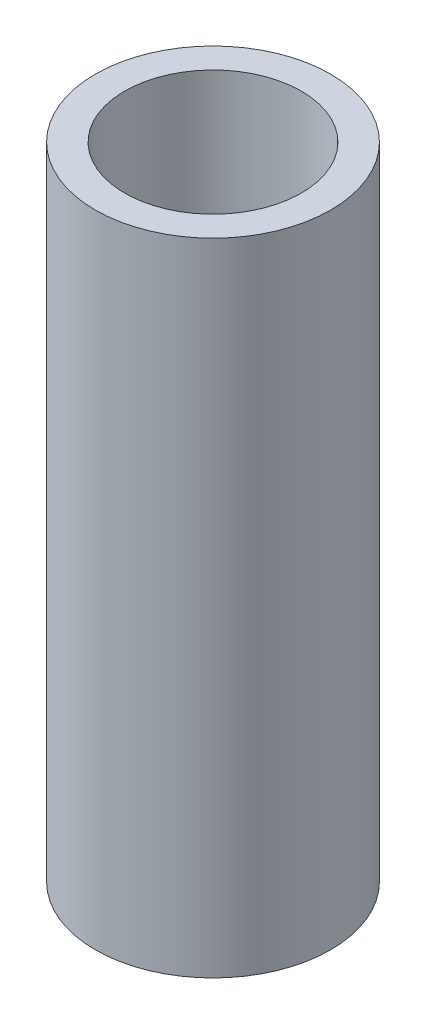
ISO-10303-21;
HEADER;
FILE_DESCRIPTION(('STEP AP214'),'2;1');
FILE_NAME('part.step','',(''),(''),'','','');
FILE_SCHEMA(('AUTOMOTIVE_DESIGN { 1 0 10303 214 1 1 1 1 }'));
ENDSEC;
DATA;
#1=APPLICATION_CONTEXT('core data for automotive mechanical design processes');
#2=APPLICATION_PROTOCOL_DEFINITION('international standard','automotive_design',2000,#1);
#3=PRODUCT_CONTEXT('',#1,'mechanical');
#4=PRODUCT('Part','Part','',(#3));
#5=PRODUCT_RELATED_PRODUCT_CATEGORY('part','',(#4));
#6=PRODUCT_DEFINITION_FORMATION('','',#4);
#7=PRODUCT_DEFINITION_CONTEXT('part definition',#1,'design');
#8=PRODUCT_DEFINITION('design','',#6,#7);
#9=PRODUCT_DEFINITION_SHAPE('','',#8);
#10=(LENGTH_UNIT() NAMED_UNIT(*) SI_UNIT(.MILLI.,.METRE.));
#11=(NAMED_UNIT(*) PLANE_ANGLE_UNIT() SI_UNIT($,.RADIAN.));
#12=(NAMED_UNIT(*) SI_UNIT($,.STERADIAN.) SOLID_ANGLE_UNIT());
#13=UNCERTAINTY_MEASURE_WITH_UNIT(LENGTH_MEASURE(1.E-05),#10,'distance_accuracy_value','');
#14=(GEOMETRIC_REPRESENTATION_CONTEXT(3) GLOBAL_UNCERTAINTY_ASSIGNED_CONTEXT((#13)) GLOBAL_UNIT_ASSIGNED_CONTEXT((#10,
#11,#12)) REPRESENTATION_CONTEXT('',''));
#15=CARTESIAN_POINT('',(0.,0.,0.));
#16=DIRECTION('',(0.,0.,1.));
#17=DIRECTION('',(1.,0.,0.));
#18=AXIS2_PLACEMENT_3D('',#15,#16,#17);
#19=CARTESIAN_POINT('',(0.,108.882062630455,0.));
#20=DIRECTION('',(0.,-1.,0.));
#21=DIRECTION('',(0.,0.,-1.));
#22=AXIS2_PLACEMENT_3D('',#19,#20,#21);
#23=CYLINDRICAL_SURFACE('',#22,20.);
#24=CARTESIAN_POINT('',(0.,108.882062630455,0.));
#25=DIRECTION('',(0.,1.,0.));
#26=DIRECTION('',(0.,0.,1.));
#27=AXIS2_PLACEMENT_3D('',#24,#25,#26);
#28=CIRCLE('',#27,20.);
#29=CARTESIAN_POINT('',(0.,108.882062630455,-20.));
#30=VERTEX_POINT('',#29);
#31=EDGE_CURVE('E10',#30,#30,#28,.T.);
#32=CARTESIAN_POINT('',(0.,0.,0.));
#33=DIRECTION('',(0.,1.,0.));
#34=DIRECTION('',(0.,0.,1.));
#35=AXIS2_PLACEMENT_3D('',#32,#33,#34);
#36=CIRCLE('',#35,20.);
#37=CARTESIAN_POINT('',(0.,0.,-20.));
#38=VERTEX_POINT('',#37);
#39=EDGE_CURVE('E37',#38,#38,#36,.T.);
#40=CARTESIAN_POINT('',(0.,108.882062630455,-20.));
#41=CARTESIAN_POINT('',(0.,107.747874478054,-20.));
#42=CARTESIAN_POINT('',(0.,106.613686325654,-20.));
#43=CARTESIAN_POINT('',(0.,104.345310020852,-20.));
#44=CARTESIAN_POINT('',(0.,103.211121868452,-20.));
#45=CARTESIAN_POINT('',(0.,100.942745563651,-20.));
#46=CARTESIAN_POINT('',(0.,99.8085574112501,-20.));
#47=CARTESIAN_POINT('',(0.,97.540181106449,-20.));
#48=CARTESIAN_POINT('',(0.,96.4059929540484,-20.));
#49=CARTESIAN_POINT('',(0.,94.1376166492472,-20.));
#50=CARTESIAN_POINT('',(0.,93.0034284968467,-20.));
#51=CARTESIAN_POINT('',(0.,90.7350521920455,-20.));
#52=CARTESIAN_POINT('',(0.,89.600864039645,-20.));
#53=CARTESIAN_POINT('',(0.,87.3324877348438,-20.));
#54=CARTESIAN_POINT('',(0.,86.1982995824433,-20.));
#55=CARTESIAN_POINT('',(0.,83.9299232776421,-20.));
#56=CARTESIAN_POINT('',(0.,82.7957351252415,-20.));
#57=CARTESIAN_POINT('',(0.,80.5273588204404,-20.));
#58=CARTESIAN_POINT('',(0.,79.3931706680398,-20.));
#59=CARTESIAN_POINT('',(0.,77.1247943632387,-20.));
#60=CARTESIAN_POINT('',(0.,75.9906062108381,-20.));
#61=CARTESIAN_POINT('',(0.,73.722229906037,-20.));
#62=CARTESIAN_POINT('',(0.,72.5880417536364,-20.));
#63=CARTESIAN_POINT('',(0.,70.3196654488353,-20.));
#64=CARTESIAN_POINT('',(0.,69.1854772964347,-20.));
#65=CARTESIAN_POINT('',(0.,66.9171009916336,-20.));
#66=CARTESIAN_POINT('',(0.,65.782912839233,-20.));
#67=CARTESIAN_POINT('',(0.,63.5145365344319,-20.));
#68=CARTESIAN_POINT('',(0.,62.3803483820313,-20.));
#69=CARTESIAN_POINT('',(0.,60.1119720772302,-20.));
#70=CARTESIAN_POINT('',(0.,58.9777839248296,-20.));
#71=CARTESIAN_POINT('',(0.,56.7094076200285,-20.));
#72=CARTESIAN_POINT('',(0.,55.5752194676279,-20.));
#73=CARTESIAN_POINT('',(0.,53.3068431628268,-20.));
#74=CARTESIAN_POINT('',(0.,52.1726550104262,-20.));
#75=CARTESIAN_POINT('',(0.,49.904278705625,-20.));
#76=CARTESIAN_POINT('',(0.,48.7700905532245,-20.));
#77=CARTESIAN_POINT('',(0.,46.5017142484233,-20.));
#78=CARTESIAN_POINT('',(0.,45.3675260960228,-20.));
#79=CARTESIAN_POINT('',(0.,43.0991497912216,-20.));
#80=CARTESIAN_POINT('',(0.,41.9649616388211,-20.));
#81=CARTESIAN_POINT('',(0.,39.6965853340199,-20.));
#82=CARTESIAN_POINT('',(0.,38.5623971816194,-20.));
#83=CARTESIAN_POINT('',(0.,36.2940208768182,-20.));
#84=CARTESIAN_POINT('',(0.,35.1598327244176,-20.));
#85=CARTESIAN_POINT('',(0.,32.8914564196165,-20.));
#86=CARTESIAN_POINT('',(0.,31.7572682672159,-20.));
#87=CARTESIAN_POINT('',(0.,29.4888919624148,-20.));
#88=CARTESIAN_POINT('',(0.,28.3547038100142,-20.));
#89=CARTESIAN_POINT('',(0.,26.0863275052131,-20.));
#90=CARTESIAN_POINT('',(0.,24.9521393528125,-20.));
#91=CARTESIAN_POINT('',(0.,22.6837630480114,-20.));
#92=CARTESIAN_POINT('',(0.,21.5495748956108,-20.));
#93=CARTESIAN_POINT('',(0.,19.2811985908097,-20.));
#94=CARTESIAN_POINT('',(0.,18.1470104384091,-20.));
#95=CARTESIAN_POINT('',(0.,15.878634133608,-20.));
#96=CARTESIAN_POINT('',(0.,14.7444459812074,-20.));
#97=CARTESIAN_POINT('',(0.,12.4760696764063,-20.));
#98=CARTESIAN_POINT('',(0.,11.3418815240057,-20.));
#99=CARTESIAN_POINT('',(0.,9.07350521920456,-20.));
#100=CARTESIAN_POINT('',(0.,7.93931706680399,-20.));
#101=CARTESIAN_POINT('',(0.,5.67094076200285,-20.));
#102=CARTESIAN_POINT('',(0.,4.53675260960228,-20.));
#103=CARTESIAN_POINT('',(0.,2.26837630480114,-20.));
#104=CARTESIAN_POINT('',(0.,1.13418815240057,-20.));
#105=CARTESIAN_POINT('',(0.,0.,-20.));
#106=B_SPLINE_CURVE_WITH_KNOTS('',3,(#40,#41,#42,#43,#44,#45,#46,#47,#48,#49,#50,#51,#52,#53,
#54,#55,#56,#57,#58,#59,#60,#61,#62,#63,#64,#65,#66,#67,#68,#69,#70,#71,#72,#73,#74,#75,#76,#77,
#78,#79,#80,#81,#82,#83,#84,#85,#86,#87,#88,#89,#90,#91,#92,#93,#94,#95,#96,#97,#98,#99,#100,
#101,#102,#103,#104,#105),.UNSPECIFIED.,.F.,.F.,(4,2,2,2,2,2,2,2,2,2,2,2,2,2,2,2,2,2,2,2,2,2,2,
2,2,2,2,2,2,2,2,2,4),(0.,3.4025644572017,6.80512891440341,10.2076933716051,13.6102578288068,
17.0128222860085,20.4153867432102,23.8179512004119,27.2205156576137,30.6230801148154,
34.0256445720171,37.4282090292188,40.8307734864205,44.2333379436222,47.6359024008239,
51.0384668580256,54.4410313152273,57.843595772429,61.2461602296307,64.6487246868324,
68.0512891440341,71.4538536012358,74.8564180584376,78.2589825156393,81.661546972841,
85.0641114300427,88.4666758872444,91.8692403444461,95.2718048016478,98.6743692588495,
102.076933716051,105.479498173253,108.882062630455),.UNSPECIFIED.);
#107=EDGE_CURVE('BSEAM40',#30,#38,#106,.T.);
#108=ORIENTED_EDGE('',*,*,#31,.F.);
#109=ORIENTED_EDGE('',*,*,#39,.T.);
#110=ORIENTED_EDGE('',*,*,#107,.T.);
#111=ORIENTED_EDGE('',*,*,#107,.F.);
#112=EDGE_LOOP('',(#108,#110,#109,#111));
#113=FACE_BOUND('',#112,.T.);
#114=ADVANCED_FACE('F40',(#113),#23,.T.);
#115=CARTESIAN_POINT('',(0.,108.882062630455,0.));
#116=DIRECTION('',(0.,1.,0.));
#117=DIRECTION('',(0.,0.,1.));
#118=AXIS2_PLACEMENT_3D('',#115,#116,#117);
#119=PLANE('',#118);
#120=CARTESIAN_POINT('',(0.,108.882062630455,0.));
#121=DIRECTION('',(0.,1.,0.));
#122=DIRECTION('',(0.,0.,1.));
#123=AXIS2_PLACEMENT_3D('',#120,#121,#122);
#124=CIRCLE('',#123,15.0164725689765);
#125=CARTESIAN_POINT('',(0.,108.882062630455,-15.0164725689765));
#126=VERTEX_POINT('',#125);
#127=EDGE_CURVE('E50',#126,#126,#124,.T.);
#128=ORIENTED_EDGE('',*,*,#127,.F.);
#129=EDGE_LOOP('',(#128));
#130=FACE_BOUND('',#129,.T.);
#131=ORIENTED_EDGE('',*,*,#31,.T.);
#132=EDGE_LOOP('',(#131));
#133=FACE_BOUND('',#132,.T.);
#134=ADVANCED_FACE('F59',(#130,#133),#119,.T.);
#135=CARTESIAN_POINT('',(0.,0.,0.));
#136=DIRECTION('',(0.,1.,0.));
#137=DIRECTION('',(0.,0.,1.));
#138=AXIS2_PLACEMENT_3D('',#135,#136,#137);
#139=PLANE('',#138);
#140=CARTESIAN_POINT('',(0.,0.,0.));
#141=DIRECTION('',(0.,1.,0.));
#142=DIRECTION('',(0.,0.,1.));
#143=AXIS2_PLACEMENT_3D('',#140,#141,#142);
#144=CIRCLE('',#143,15.0164725689765);
#145=CARTESIAN_POINT('',(0.,0.,-15.0164725689765));
#146=VERTEX_POINT('',#145);
#147=EDGE_CURVE('E47',#146,#146,#144,.T.);
#148=ORIENTED_EDGE('',*,*,#147,.T.);
#149=EDGE_LOOP('',(#148));
#150=FACE_BOUND('',#149,.T.);
#151=ORIENTED_EDGE('',*,*,#39,.F.);
#152=EDGE_LOOP('',(#151));
#153=FACE_BOUND('',#152,.T.);
#154=ADVANCED_FACE('F58',(#150,#153),#139,.F.);
#155=CARTESIAN_POINT('',(0.,108.882062630455,0.));
#156=DIRECTION('',(0.,-1.,0.));
#157=DIRECTION('',(0.,0.,-1.));
#158=AXIS2_PLACEMENT_3D('',#155,#156,#157);
#159=CYLINDRICAL_SURFACE('',#158,15.0164725689765);
#160=CARTESIAN_POINT('',(0.,108.882062630455,-15.0164725689765));
#161=CARTESIAN_POINT('',(0.,107.747874478054,-15.0164725689765));
#162=CARTESIAN_POINT('',(0.,106.613686325654,-15.0164725689765));
#163=CARTESIAN_POINT('',(0.,104.345310020852,-15.0164725689765));
#164=CARTESIAN_POINT('',(0.,103.211121868452,-15.0164725689765));
#165=CARTESIAN_POINT('',(0.,100.942745563651,-15.0164725689765));
#166=CARTESIAN_POINT('',(0.,99.8085574112501,-15.0164725689765));
#167=CARTESIAN_POINT('',(0.,97.540181106449,-15.0164725689765));
#168=CARTESIAN_POINT('',(0.,96.4059929540484,-15.0164725689765));
#169=CARTESIAN_POINT('',(0.,94.1376166492472,-15.0164725689765));
#170=CARTESIAN_POINT('',(0.,93.0034284968467,-15.0164725689765));
#171=CARTESIAN_POINT('',(0.,90.7350521920455,-15.0164725689765));
#172=CARTESIAN_POINT('',(0.,89.600864039645,-15.0164725689765));
#173=CARTESIAN_POINT('',(0.,87.3324877348438,-15.0164725689765));
#174=CARTESIAN_POINT('',(0.,86.1982995824433,-15.0164725689765));
#175=CARTESIAN_POINT('',(0.,83.9299232776421,-15.0164725689765));
#176=CARTESIAN_POINT('',(0.,82.7957351252415,-15.0164725689765));
#177=CARTESIAN_POINT('',(0.,80.5273588204404,-15.0164725689765));
#178=CARTESIAN_POINT('',(0.,79.3931706680398,-15.0164725689765));
#179=CARTESIAN_POINT('',(0.,77.1247943632387,-15.0164725689765));
#180=CARTESIAN_POINT('',(0.,75.9906062108381,-15.0164725689765));
#181=CARTESIAN_POINT('',(0.,73.722229906037,-15.0164725689765));
#182=CARTESIAN_POINT('',(0.,72.5880417536364,-15.0164725689765));
#183=CARTESIAN_POINT('',(0.,70.3196654488353,-15.0164725689765));
#184=CARTESIAN_POINT('',(0.,69.1854772964347,-15.0164725689765));
#185=CARTESIAN_POINT('',(0.,66.9171009916336,-15.0164725689765));
#186=CARTESIAN_POINT('',(0.,65.782912839233,-15.0164725689765));
#187=CARTESIAN_POINT('',(0.,63.5145365344319,-15.0164725689765));
#188=CARTESIAN_POINT('',(0.,62.3803483820313,-15.0164725689765));
#189=CARTESIAN_POINT('',(0.,60.1119720772302,-15.0164725689765));
#190=CARTESIAN_POINT('',(0.,58.9777839248296,-15.0164725689765));
#191=CARTESIAN_POINT('',(0.,56.7094076200285,-15.0164725689765));
#192=CARTESIAN_POINT('',(0.,55.5752194676279,-15.0164725689765));
#193=CARTESIAN_POINT('',(0.,53.3068431628268,-15.0164725689765));
#194=CARTESIAN_POINT('',(0.,52.1726550104262,-15.0164725689765));
#195=CARTESIAN_POINT('',(0.,49.904278705625,-15.0164725689765));
#196=CARTESIAN_POINT('',(0.,48.7700905532245,-15.0164725689765));
#197=CARTESIAN_POINT('',(0.,46.5017142484233,-15.0164725689765));
#198=CARTESIAN_POINT('',(0.,45.3675260960228,-15.0164725689765));
#199=CARTESIAN_POINT('',(0.,43.0991497912216,-15.0164725689765));
#200=CARTESIAN_POINT('',(0.,41.9649616388211,-15.0164725689765));
#201=CARTESIAN_POINT('',(0.,39.6965853340199,-15.0164725689765));
#202=CARTESIAN_POINT('',(0.,38.5623971816194,-15.0164725689765));
#203=CARTESIAN_POINT('',(0.,36.2940208768182,-15.0164725689765));
#204=CARTESIAN_POINT('',(0.,35.1598327244176,-15.0164725689765));
#205=CARTESIAN_POINT('',(0.,32.8914564196165,-15.0164725689765));
#206=CARTESIAN_POINT('',(0.,31.7572682672159,-15.0164725689765));
#207=CARTESIAN_POINT('',(0.,29.4888919624148,-15.0164725689765));
#208=CARTESIAN_POINT('',(0.,28.3547038100142,-15.0164725689765));
#209=CARTESIAN_POINT('',(0.,26.0863275052131,-15.0164725689765));
#210=CARTESIAN_POINT('',(0.,24.9521393528125,-15.0164725689765));
#211=CARTESIAN_POINT('',(0.,22.6837630480114,-15.0164725689765));
#212=CARTESIAN_POINT('',(0.,21.5495748956108,-15.0164725689765));
#213=CARTESIAN_POINT('',(0.,19.2811985908097,-15.0164725689765));
#214=CARTESIAN_POINT('',(0.,18.1470104384091,-15.0164725689765));
#215=CARTESIAN_POINT('',(0.,15.878634133608,-15.0164725689765));
#216=CARTESIAN_POINT('',(0.,14.7444459812074,-15.0164725689765));
#217=CARTESIAN_POINT('',(0.,12.4760696764063,-15.0164725689765));
#218=CARTESIAN_POINT('',(0.,11.3418815240057,-15.0164725689765));
#219=CARTESIAN_POINT('',(0.,9.07350521920456,-15.0164725689765));
#220=CARTESIAN_POINT('',(0.,7.93931706680399,-15.0164725689765));
#221=CARTESIAN_POINT('',(0.,5.67094076200285,-15.0164725689765));
#222=CARTESIAN_POINT('',(0.,4.53675260960228,-15.0164725689765));
#223=CARTESIAN_POINT('',(0.,2.26837630480114,-15.0164725689765));
#224=CARTESIAN_POINT('',(0.,1.13418815240057,-15.0164725689765));
#225=CARTESIAN_POINT('',(0.,0.,-15.0164725689765));
#226=B_SPLINE_CURVE_WITH_KNOTS('',3,(#160,#161,#162,#163,#164,#165,#166,#167,#168,#169,#170,
#171,#172,#173,#174,#175,#176,#177,#178,#179,#180,#181,#182,#183,#184,#185,#186,#187,#188,#189,
#190,#191,#192,#193,#194,#195,#196,#197,#198,#199,#200,#201,#202,#203,#204,#205,#206,#207,#208,
#209,#210,#211,#212,#213,#214,#215,#216,#217,#218,#219,#220,#221,#222,#223,#224,#225),
.UNSPECIFIED.,.F.,.F.,(4,2,2,2,2,2,2,2,2,2,2,2,2,2,2,2,2,2,2,2,2,2,2,2,2,2,2,2,2,2,2,2,4),(0.,
3.4025644572017,6.80512891440341,10.2076933716051,13.6102578288068,17.0128222860085,
20.4153867432102,23.8179512004119,27.2205156576137,30.6230801148154,34.0256445720171,
37.4282090292188,40.8307734864205,44.2333379436222,47.6359024008239,51.0384668580256,
54.4410313152273,57.843595772429,61.2461602296307,64.6487246868324,68.0512891440341,
71.4538536012358,74.8564180584376,78.2589825156393,81.661546972841,85.0641114300427,
88.4666758872444,91.8692403444461,95.2718048016478,98.6743692588495,102.076933716051,
105.479498173253,108.882062630455),.UNSPECIFIED.);
#227=EDGE_CURVE('BSEAM54',#126,#146,#226,.T.);
#228=ORIENTED_EDGE('',*,*,#127,.T.);
#229=ORIENTED_EDGE('',*,*,#147,.F.);
#230=ORIENTED_EDGE('',*,*,#227,.T.);
#231=ORIENTED_EDGE('',*,*,#227,.F.);
#232=EDGE_LOOP('',(#228,#230,#229,#231));
#233=FACE_BOUND('',#232,.T.);
#234=ADVANCED_FACE('F54',(#233),#159,.F.);
#235=CLOSED_SHELL('',(#114,#134,#154,#234));
#236=MANIFOLD_SOLID_BREP('B2',#235);
#237=ADVANCED_BREP_SHAPE_REPRESENTATION('',(#18,#236),#14);
#238=SHAPE_DEFINITION_REPRESENTATION(#9,#237);
ENDSEC;
END-ISO-10303-21;
